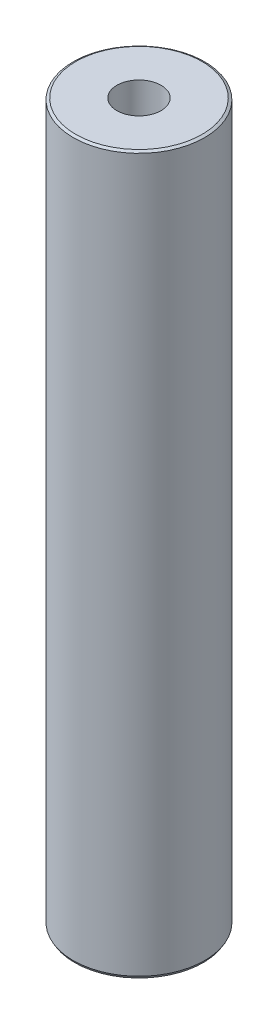
ISO-10303-21;
HEADER;
FILE_DESCRIPTION(('STEP AP214'),'2;1');
FILE_NAME('part.step','',(''),(''),'','','');
FILE_SCHEMA(('AUTOMOTIVE_DESIGN { 1 0 10303 214 1 1 1 1 }'));
ENDSEC;
DATA;
#1=APPLICATION_CONTEXT('core data for automotive mechanical design processes');
#2=APPLICATION_PROTOCOL_DEFINITION('international standard','automotive_design',2000,#1);
#3=PRODUCT_CONTEXT('',#1,'mechanical');
#4=PRODUCT('Part','Part','',(#3));
#5=PRODUCT_RELATED_PRODUCT_CATEGORY('part','',(#4));
#6=PRODUCT_DEFINITION_FORMATION('','',#4);
#7=PRODUCT_DEFINITION_CONTEXT('part definition',#1,'design');
#8=PRODUCT_DEFINITION('design','',#6,#7);
#9=PRODUCT_DEFINITION_SHAPE('','',#8);
#10=(LENGTH_UNIT() NAMED_UNIT(*) SI_UNIT(.MILLI.,.METRE.));
#11=(NAMED_UNIT(*) PLANE_ANGLE_UNIT() SI_UNIT($,.RADIAN.));
#12=(NAMED_UNIT(*) SI_UNIT($,.STERADIAN.) SOLID_ANGLE_UNIT());
#13=UNCERTAINTY_MEASURE_WITH_UNIT(LENGTH_MEASURE(1.E-05),#10,'distance_accuracy_value','');
#14=(GEOMETRIC_REPRESENTATION_CONTEXT(3) GLOBAL_UNCERTAINTY_ASSIGNED_CONTEXT((#13)) GLOBAL_UNIT_ASSIGNED_CONTEXT((#10,
#11,#12)) REPRESENTATION_CONTEXT('',''));
#15=CARTESIAN_POINT('',(0.,0.,0.));
#16=DIRECTION('',(0.,0.,1.));
#17=DIRECTION('',(1.,0.,0.));
#18=AXIS2_PLACEMENT_3D('',#15,#16,#17);
#19=CARTESIAN_POINT('',(0.,517.919963904993,0.));
#20=DIRECTION('',(0.,-1.,0.));
#21=DIRECTION('',(0.,0.,-1.));
#22=AXIS2_PLACEMENT_3D('',#19,#20,#21);
#23=CYLINDRICAL_SURFACE('',#22,47.5);
#24=CARTESIAN_POINT('',(0.,516.84636763683,0.));
#25=DIRECTION('',(0.,1.,0.));
#26=DIRECTION('',(0.,0.,1.));
#27=AXIS2_PLACEMENT_3D('',#24,#25,#26);
#28=CIRCLE('',#27,47.5);
#29=CARTESIAN_POINT('',(0.,516.84636763683,47.5));
#30=VERTEX_POINT('',#29);
#31=EDGE_CURVE('E50',#30,#30,#28,.F.);
#32=ORIENTED_EDGE('',*,*,#31,.T.);
#33=EDGE_LOOP('',(#32));
#34=FACE_BOUND('',#33,.T.);
#35=CARTESIAN_POINT('',(0.,1.85952328327543,0.));
#36=DIRECTION('',(0.,1.,0.));
#37=DIRECTION('',(0.,0.,1.));
#38=AXIS2_PLACEMENT_3D('',#35,#36,#37);
#39=CIRCLE('',#38,47.5);
#40=CARTESIAN_POINT('',(0.,1.85952328327543,47.5));
#41=VERTEX_POINT('',#40);
#42=EDGE_CURVE('E51',#41,#41,#39,.T.);
#43=ORIENTED_EDGE('',*,*,#42,.T.);
#44=EDGE_LOOP('',(#43));
#45=FACE_BOUND('',#44,.T.);
#46=ADVANCED_FACE('F39',(#34,#45),#23,.T.);
#47=CARTESIAN_POINT('',(0.,517.919963904993,0.));
#48=DIRECTION('',(0.,1.,0.));
#49=DIRECTION('',(0.,0.,1.));
#50=AXIS2_PLACEMENT_3D('',#47,#48,#49);
#51=PLANE('',#50);
#52=CARTESIAN_POINT('',(0.,517.919963904993,0.));
#53=DIRECTION('',(0.,1.,0.));
#54=DIRECTION('',(0.,0.,1.));
#55=AXIS2_PLACEMENT_3D('',#52,#53,#54);
#56=CIRCLE('',#55,45.6404767167245);
#57=CARTESIAN_POINT('',(0.,517.919963904993,45.6404767167245));
#58=VERTEX_POINT('',#57);
#59=EDGE_CURVE('E54',#58,#58,#56,.T.);
#60=ORIENTED_EDGE('',*,*,#59,.T.);
#61=EDGE_LOOP('',(#60));
#62=FACE_BOUND('',#61,.T.);
#63=CARTESIAN_POINT('',(0.,517.919963904993,0.));
#64=DIRECTION('',(0.,1.,0.));
#65=DIRECTION('',(0.,0.,1.));
#66=AXIS2_PLACEMENT_3D('',#63,#64,#65);
#67=CIRCLE('',#66,15.9450227161933);
#68=CARTESIAN_POINT('',(0.,517.919963904993,15.9450227161933));
#69=VERTEX_POINT('',#68);
#70=EDGE_CURVE('E58',#69,#69,#67,.T.);
#71=ORIENTED_EDGE('',*,*,#70,.F.);
#72=EDGE_LOOP('',(#71));
#73=FACE_BOUND('',#72,.T.);
#74=ADVANCED_FACE('F69',(#62,#73),#51,.T.);
#75=CARTESIAN_POINT('',(0.,0.,0.));
#76=DIRECTION('',(0.,1.,0.));
#77=DIRECTION('',(0.,0.,1.));
#78=AXIS2_PLACEMENT_3D('',#75,#76,#77);
#79=PLANE('',#78);
#80=CARTESIAN_POINT('',(0.,0.,0.));
#81=DIRECTION('',(0.,1.,0.));
#82=DIRECTION('',(0.,0.,1.));
#83=AXIS2_PLACEMENT_3D('',#80,#81,#82);
#84=CIRCLE('',#83,46.4264037318366);
#85=CARTESIAN_POINT('',(0.,0.,46.4264037318366));
#86=VERTEX_POINT('',#85);
#87=EDGE_CURVE('E10',#86,#86,#84,.F.);
#88=ORIENTED_EDGE('',*,*,#87,.T.);
#89=EDGE_LOOP('',(#88));
#90=FACE_BOUND('',#89,.T.);
#91=CARTESIAN_POINT('',(0.,0.,0.));
#92=DIRECTION('',(0.,1.,0.));
#93=DIRECTION('',(0.,0.,1.));
#94=AXIS2_PLACEMENT_3D('',#91,#92,#93);
#95=CIRCLE('',#94,15.9450227161933);
#96=CARTESIAN_POINT('',(0.,0.,15.9450227161933));
#97=VERTEX_POINT('',#96);
#98=EDGE_CURVE('E63',#97,#97,#95,.T.);
#99=ORIENTED_EDGE('',*,*,#98,.T.);
#100=EDGE_LOOP('',(#99));
#101=FACE_BOUND('',#100,.T.);
#102=ADVANCED_FACE('F75',(#90,#101),#79,.F.);
#103=CARTESIAN_POINT('',(0.,517.919963904993,0.));
#104=DIRECTION('',(0.,-1.,0.));
#105=DIRECTION('',(0.,0.,-1.));
#106=AXIS2_PLACEMENT_3D('',#103,#104,#105);
#107=CYLINDRICAL_SURFACE('',#106,15.9450227161933);
#108=ORIENTED_EDGE('',*,*,#70,.T.);
#109=EDGE_LOOP('',(#108));
#110=FACE_BOUND('',#109,.T.);
#111=ORIENTED_EDGE('',*,*,#98,.F.);
#112=EDGE_LOOP('',(#111));
#113=FACE_BOUND('',#112,.T.);
#114=ADVANCED_FACE('F70',(#110,#113),#107,.F.);
#115=CARTESIAN_POINT('',(0.,517.919963904993,0.));
#116=DIRECTION('',(0.,-1.,0.));
#117=DIRECTION('',(0.,0.,-1.));
#118=AXIS2_PLACEMENT_3D('',#115,#116,#117);
#119=CONICAL_SURFACE('',#118,45.6404767167245,1.04719755119659);
#120=ORIENTED_EDGE('',*,*,#31,.F.);
#121=EDGE_LOOP('',(#120));
#122=FACE_BOUND('',#121,.T.);
#123=ORIENTED_EDGE('',*,*,#59,.F.);
#124=EDGE_LOOP('',(#123));
#125=FACE_BOUND('',#124,.T.);
#126=ADVANCED_FACE('F81',(#122,#125),#119,.T.);
#127=CARTESIAN_POINT('',(0.,1.85952328327543,0.));
#128=DIRECTION('',(0.,1.,0.));
#129=DIRECTION('',(0.,0.,1.));
#130=AXIS2_PLACEMENT_3D('',#127,#128,#129);
#131=CONICAL_SURFACE('',#130,47.5,0.523598775598295);
#132=CARTESIAN_POINT('',(0.,0.,46.4264037318366));
#133=CARTESIAN_POINT('',(0.,0.0193700342007848,46.4375870262966));
#134=CARTESIAN_POINT('',(0.,0.038740068401571,46.4487703207566));
#135=CARTESIAN_POINT('',(0.,0.0774801368031432,46.4711369096767));
#136=CARTESIAN_POINT('',(0.,0.0968501710039292,46.4823202041367));
#137=CARTESIAN_POINT('',(0.,0.1355902394055,46.5046867930568));
#138=CARTESIAN_POINT('',(0.,0.154960273606285,46.5158700875169));
#139=CARTESIAN_POINT('',(0.,0.193700342007857,46.5382366764369));
#140=CARTESIAN_POINT('',(0.,0.213070376208643,46.549419970897));
#141=CARTESIAN_POINT('',(0.,0.251810444610215,46.571786559817));
#142=CARTESIAN_POINT('',(0.,0.271180478811,46.5829698542771));
#143=CARTESIAN_POINT('',(0.,0.309920547212572,46.6053364431971));
#144=CARTESIAN_POINT('',(0.,0.329290581413357,46.6165197376572));
#145=CARTESIAN_POINT('',(0.,0.368030649814929,46.6388863265772));
#146=CARTESIAN_POINT('',(0.,0.387400684015716,46.6500696210373));
#147=CARTESIAN_POINT('',(0.,0.426140752417287,46.6724362099574));
#148=CARTESIAN_POINT('',(0.,0.445510786618072,46.6836195044174));
#149=CARTESIAN_POINT('',(0.,0.484250855019643,46.7059860933375));
#150=CARTESIAN_POINT('',(0.,0.503620889220429,46.7171693877975));
#151=CARTESIAN_POINT('',(0.,0.542360957622001,46.7395359767176));
#152=CARTESIAN_POINT('',(0.,0.561730991822787,46.7507192711776));
#153=CARTESIAN_POINT('',(0.,0.600471060224358,46.7730858600977));
#154=CARTESIAN_POINT('',(0.,0.619841094425145,46.7842691545577));
#155=CARTESIAN_POINT('',(0.,0.658581162826716,46.8066357434778));
#156=CARTESIAN_POINT('',(0.,0.677951197027501,46.8178190379378));
#157=CARTESIAN_POINT('',(0.,0.716691265429072,46.8401856268579));
#158=CARTESIAN_POINT('',(0.,0.736061299629859,46.8513689213179));
#159=CARTESIAN_POINT('',(0.,0.774801368031431,46.873735510238));
#160=CARTESIAN_POINT('',(0.,0.794171402232216,46.884918804698));
#161=CARTESIAN_POINT('',(0.,0.832911470633787,46.9072853936181));
#162=CARTESIAN_POINT('',(0.,0.852281504834573,46.9184686880781));
#163=CARTESIAN_POINT('',(0.,0.891021573236145,46.9408352769982));
#164=CARTESIAN_POINT('',(0.,0.910391607436931,46.9520185714582));
#165=CARTESIAN_POINT('',(0.,0.949131675838502,46.9743851603783));
#166=CARTESIAN_POINT('',(0.,0.968501710039287,46.9855684548384));
#167=CARTESIAN_POINT('',(0.,1.00724177844086,47.0079350437584));
#168=CARTESIAN_POINT('',(0.,1.02661181264165,47.0191183382185));
#169=CARTESIAN_POINT('',(0.,1.06535188104322,47.0414849271385));
#170=CARTESIAN_POINT('',(0.,1.084721915244,47.0526682215986));
#171=CARTESIAN_POINT('',(0.,1.12346198364557,47.0750348105186));
#172=CARTESIAN_POINT('',(0.,1.14283201784636,47.0862181049787));
#173=CARTESIAN_POINT('',(0.,1.18157208624793,47.1085846938988));
#174=CARTESIAN_POINT('',(0.,1.20094212044872,47.1197679883588));
#175=CARTESIAN_POINT('',(0.,1.23968218885029,47.1421345772789));
#176=CARTESIAN_POINT('',(0.,1.25905222305107,47.1533178717389));
#177=CARTESIAN_POINT('',(0.,1.29779229145265,47.175684460659));
#178=CARTESIAN_POINT('',(0.,1.31716232565343,47.186867755119));
#179=CARTESIAN_POINT('',(0.,1.355902394055,47.2092343440391));
#180=CARTESIAN_POINT('',(0.,1.37527242825579,47.2204176384991));
#181=CARTESIAN_POINT('',(0.,1.41401249665736,47.2427842274192));
#182=CARTESIAN_POINT('',(0.,1.43338253085815,47.2539675218792));
#183=CARTESIAN_POINT('',(0.,1.47212259925972,47.2763341107993));
#184=CARTESIAN_POINT('',(0.,1.4914926334605,47.2875174052593));
#185=CARTESIAN_POINT('',(0.,1.53023270186207,47.3098839941794));
#186=CARTESIAN_POINT('',(0.,1.54960273606286,47.3210672886394));
#187=CARTESIAN_POINT('',(0.,1.58834280446443,47.3434338775595));
#188=CARTESIAN_POINT('',(0.,1.60771283866522,47.3546171720195));
#189=CARTESIAN_POINT('',(0.,1.64645290706679,47.3769837609396));
#190=CARTESIAN_POINT('',(0.,1.66582294126758,47.3881670553996));
#191=CARTESIAN_POINT('',(0.,1.70456300966915,47.4105336443197));
#192=CARTESIAN_POINT('',(0.,1.72393304386993,47.4217169387798));
#193=CARTESIAN_POINT('',(0.,1.7626731122715,47.4440835276998));
#194=CARTESIAN_POINT('',(0.,1.78204314647229,47.4552668221599));
#195=CARTESIAN_POINT('',(0.,1.82078321487386,47.4776334110799));
#196=CARTESIAN_POINT('',(0.,1.84015324907465,47.48881670554));
#197=CARTESIAN_POINT('',(0.,1.85952328327543,47.5));
#198=B_SPLINE_CURVE_WITH_KNOTS('',3,(#132,#133,#134,#135,#136,#137,#138,#139,#140,#141,#142,
#143,#144,#145,#146,#147,#148,#149,#150,#151,#152,#153,#154,#155,#156,#157,#158,#159,#160,#161,
#162,#163,#164,#165,#166,#167,#168,#169,#170,#171,#172,#173,#174,#175,#176,#177,#178,#179,#180,
#181,#182,#183,#184,#185,#186,#187,#188,#189,#190,#191,#192,#193,#194,#195,#196,#197),
.UNSPECIFIED.,.F.,.F.,(4,2,2,2,2,2,2,2,2,2,2,2,2,2,2,2,2,2,2,2,2,2,2,2,2,2,2,2,2,2,2,2,4),(0.,
0.0670997667602146,0.134199533520429,0.201299300280647,0.268399067040862,0.335498833801076,
0.402598600561291,0.469698367321506,0.536798134081724,0.603897900841938,0.670997667602153,
0.738097434362368,0.805197201122586,0.8722969678828,0.939396734643015,1.00649650140323,
1.07359626816344,1.14069603492366,1.20779580168388,1.27489556844409,1.34199533520431,
1.40909510196452,1.47619486872474,1.54329463548495,1.61039440224517,1.67749416900538,
1.7445939357656,1.81169370252581,1.87879346928603,1.94589323604624,2.01299300280646,
2.08009276956668,2.14719253632689),.UNSPECIFIED.);
#199=EDGE_CURVE('BSEAM45',#86,#41,#198,.T.);
#200=ORIENTED_EDGE('',*,*,#87,.F.);
#201=ORIENTED_EDGE('',*,*,#42,.F.);
#202=ORIENTED_EDGE('',*,*,#199,.T.);
#203=ORIENTED_EDGE('',*,*,#199,.F.);
#204=EDGE_LOOP('',(#200,#202,#201,#203));
#205=FACE_BOUND('',#204,.T.);
#206=ADVANCED_FACE('F45',(#205),#131,.T.);
#207=CLOSED_SHELL('',(#46,#74,#102,#114,#126,#206));
#208=MANIFOLD_SOLID_BREP('B2',#207);
#209=ADVANCED_BREP_SHAPE_REPRESENTATION('',(#18,#208),#14);
#210=SHAPE_DEFINITION_REPRESENTATION(#9,#209);
ENDSEC;
END-ISO-10303-21;
